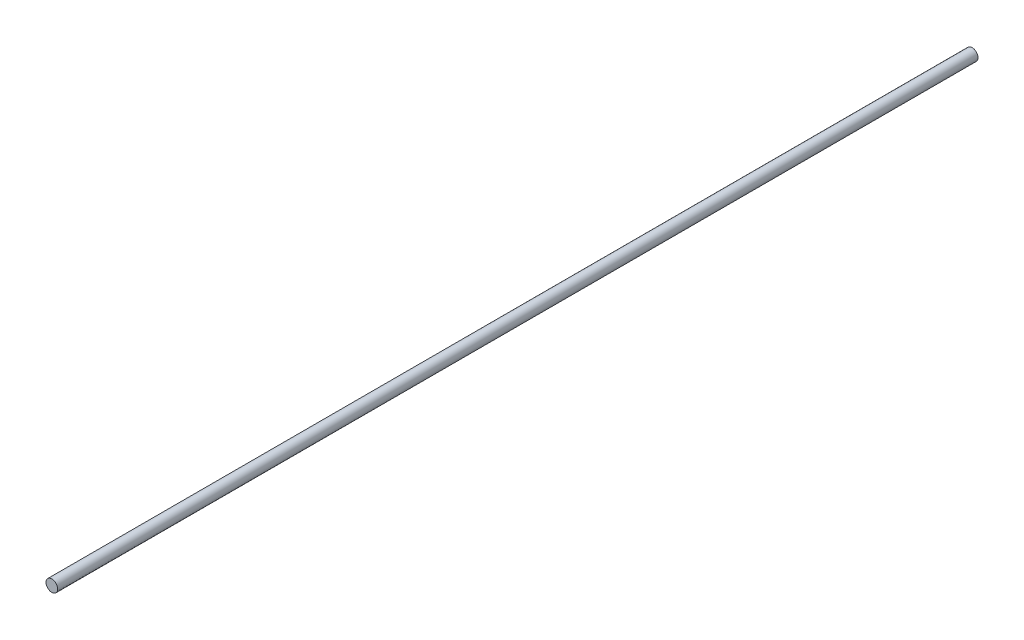
ISO-10303-21;
HEADER;
FILE_DESCRIPTION(('STEP AP214'),'2;1');
FILE_NAME('part.step','',(''),(''),'','','');
FILE_SCHEMA(('AUTOMOTIVE_DESIGN { 1 0 10303 214 1 1 1 1 }'));
ENDSEC;
DATA;
#1=APPLICATION_CONTEXT('core data for automotive mechanical design processes');
#2=APPLICATION_PROTOCOL_DEFINITION('international standard','automotive_design',2000,#1);
#3=PRODUCT_CONTEXT('',#1,'mechanical');
#4=PRODUCT('Part','Part','',(#3));
#5=PRODUCT_RELATED_PRODUCT_CATEGORY('part','',(#4));
#6=PRODUCT_DEFINITION_FORMATION('','',#4);
#7=PRODUCT_DEFINITION_CONTEXT('part definition',#1,'design');
#8=PRODUCT_DEFINITION('design','',#6,#7);
#9=PRODUCT_DEFINITION_SHAPE('','',#8);
#10=(LENGTH_UNIT() NAMED_UNIT(*) SI_UNIT(.MILLI.,.METRE.));
#11=(NAMED_UNIT(*) PLANE_ANGLE_UNIT() SI_UNIT($,.RADIAN.));
#12=(NAMED_UNIT(*) SI_UNIT($,.STERADIAN.) SOLID_ANGLE_UNIT());
#13=UNCERTAINTY_MEASURE_WITH_UNIT(LENGTH_MEASURE(1.E-05),#10,'distance_accuracy_value','');
#14=(GEOMETRIC_REPRESENTATION_CONTEXT(3) GLOBAL_UNCERTAINTY_ASSIGNED_CONTEXT((#13)) GLOBAL_UNIT_ASSIGNED_CONTEXT((#10,
#11,#12)) REPRESENTATION_CONTEXT('',''));
#15=CARTESIAN_POINT('',(0.,0.,0.));
#16=DIRECTION('',(0.,0.,1.));
#17=DIRECTION('',(1.,0.,0.));
#18=AXIS2_PLACEMENT_3D('',#15,#16,#17);
#19=CARTESIAN_POINT('',(0.,0.,153.75));
#20=DIRECTION('',(0.,0.,-1.));
#21=DIRECTION('',(-1.,0.,0.));
#22=AXIS2_PLACEMENT_3D('',#19,#20,#21);
#23=CYLINDRICAL_SURFACE('',#22,0.975);
#24=CARTESIAN_POINT('',(0.,0.,153.75));
#25=DIRECTION('',(0.,0.,1.));
#26=DIRECTION('',(1.,0.,0.));
#27=AXIS2_PLACEMENT_3D('',#24,#25,#26);
#28=CIRCLE('',#27,0.975);
#29=CARTESIAN_POINT('',(0.975,0.,153.75));
#30=VERTEX_POINT('',#29);
#31=EDGE_CURVE('E11',#30,#30,#28,.T.);
#32=ORIENTED_EDGE('',*,*,#31,.F.);
#33=EDGE_LOOP('',(#32));
#34=FACE_BOUND('',#33,.T.);
#35=CARTESIAN_POINT('',(0.,0.,0.));
#36=DIRECTION('',(0.,0.,1.));
#37=DIRECTION('',(1.,0.,0.));
#38=AXIS2_PLACEMENT_3D('',#35,#36,#37);
#39=CIRCLE('',#38,0.975);
#40=CARTESIAN_POINT('',(0.975,0.,0.));
#41=VERTEX_POINT('',#40);
#42=EDGE_CURVE('E47',#41,#41,#39,.T.);
#43=ORIENTED_EDGE('',*,*,#42,.T.);
#44=EDGE_LOOP('',(#43));
#45=FACE_BOUND('',#44,.T.);
#46=ADVANCED_FACE('F44',(#34,#45),#23,.T.);
#47=CARTESIAN_POINT('',(0.,0.,153.75));
#48=DIRECTION('',(0.,0.,1.));
#49=DIRECTION('',(1.,0.,0.));
#50=AXIS2_PLACEMENT_3D('',#47,#48,#49);
#51=PLANE('',#50);
#52=ORIENTED_EDGE('',*,*,#31,.T.);
#53=EDGE_LOOP('',(#52));
#54=FACE_BOUND('',#53,.T.);
#55=ADVANCED_FACE('F136',(#54),#51,.T.);
#56=CARTESIAN_POINT('',(0.,0.,0.));
#57=DIRECTION('',(0.,0.,1.));
#58=DIRECTION('',(1.,0.,0.));
#59=AXIS2_PLACEMENT_3D('',#56,#57,#58);
#60=PLANE('',#59);
#61=DIRECTION('',(-1.,0.,0.));
#62=VECTOR('',#61,1.);
#63=CARTESIAN_POINT('',(0.5,-0.5,0.));
#64=LINE('',#63,#62);
#65=CARTESIAN_POINT('',(0.5,-0.5,0.));
#66=VERTEX_POINT('',#65);
#67=CARTESIAN_POINT('',(-0.5,-0.5,0.));
#68=VERTEX_POINT('',#67);
#69=EDGE_CURVE('E93',#66,#68,#64,.T.);
#70=ORIENTED_EDGE('',*,*,#69,.F.);
#71=DIRECTION('',(0.,-1.,0.));
#72=VECTOR('',#71,1.);
#73=CARTESIAN_POINT('',(0.5,0.5,0.));
#74=LINE('',#73,#72);
#75=CARTESIAN_POINT('',(0.5,0.5,0.));
#76=VERTEX_POINT('',#75);
#77=EDGE_CURVE('E58',#76,#66,#74,.T.);
#78=ORIENTED_EDGE('',*,*,#77,.F.);
#79=DIRECTION('',(1.,0.,0.));
#80=VECTOR('',#79,1.);
#81=CARTESIAN_POINT('',(0.5,0.5,0.));
#82=LINE('',#81,#80);
#83=CARTESIAN_POINT('',(-0.5,0.5,0.));
#84=VERTEX_POINT('',#83);
#85=EDGE_CURVE('E109',#84,#76,#82,.T.);
#86=ORIENTED_EDGE('',*,*,#85,.F.);
#87=DIRECTION('',(0.,1.,0.));
#88=VECTOR('',#87,1.);
#89=CARTESIAN_POINT('',(-0.5,0.5,0.));
#90=LINE('',#89,#88);
#91=EDGE_CURVE('E115',#68,#84,#90,.T.);
#92=ORIENTED_EDGE('',*,*,#91,.F.);
#93=EDGE_LOOP('',(#70,#78,#86,#92));
#94=FACE_BOUND('',#93,.T.);
#95=ORIENTED_EDGE('',*,*,#42,.F.);
#96=EDGE_LOOP('',(#95));
#97=FACE_BOUND('',#96,.T.);
#98=ADVANCED_FACE('F121',(#94,#97),#60,.F.);
#99=CARTESIAN_POINT('',(0.5,0.5,5.));
#100=DIRECTION('',(1.,0.,0.));
#101=DIRECTION('',(0.,0.,-1.));
#102=AXIS2_PLACEMENT_3D('',#99,#100,#101);
#103=PLANE('',#102);
#104=ORIENTED_EDGE('',*,*,#77,.T.);
#105=DIRECTION('',(0.,0.,-1.));
#106=VECTOR('',#105,1.);
#107=CARTESIAN_POINT('',(0.5,-0.5,5.));
#108=LINE('',#107,#106);
#109=CARTESIAN_POINT('',(0.5,-0.5,5.));
#110=VERTEX_POINT('',#109);
#111=EDGE_CURVE('E81',#110,#66,#108,.T.);
#112=ORIENTED_EDGE('',*,*,#111,.F.);
#113=DIRECTION('',(0.,-1.,0.));
#114=VECTOR('',#113,1.);
#115=CARTESIAN_POINT('',(0.5,0.5,5.));
#116=LINE('',#115,#114);
#117=CARTESIAN_POINT('',(0.5,0.5,5.));
#118=VERTEX_POINT('',#117);
#119=EDGE_CURVE('E107',#118,#110,#116,.T.);
#120=ORIENTED_EDGE('',*,*,#119,.F.);
#121=DIRECTION('',(0.,0.,-1.));
#122=VECTOR('',#121,1.);
#123=CARTESIAN_POINT('',(0.5,0.5,5.));
#124=LINE('',#123,#122);
#125=EDGE_CURVE('E66',#118,#76,#124,.T.);
#126=ORIENTED_EDGE('',*,*,#125,.T.);
#127=EDGE_LOOP('',(#104,#112,#120,#126));
#128=FACE_BOUND('',#127,.T.);
#129=ADVANCED_FACE('F126',(#128),#103,.F.);
#130=CARTESIAN_POINT('',(0.5,0.5,5.));
#131=DIRECTION('',(0.,1.,0.));
#132=DIRECTION('',(0.,0.,1.));
#133=AXIS2_PLACEMENT_3D('',#130,#131,#132);
#134=PLANE('',#133);
#135=ORIENTED_EDGE('',*,*,#85,.T.);
#136=ORIENTED_EDGE('',*,*,#125,.F.);
#137=DIRECTION('',(1.,0.,0.));
#138=VECTOR('',#137,1.);
#139=CARTESIAN_POINT('',(0.5,0.5,5.));
#140=LINE('',#139,#138);
#141=CARTESIAN_POINT('',(-0.5,0.5,5.));
#142=VERTEX_POINT('',#141);
#143=EDGE_CURVE('E104',#142,#118,#140,.T.);
#144=ORIENTED_EDGE('',*,*,#143,.F.);
#145=DIRECTION('',(0.,0.,-1.));
#146=VECTOR('',#145,1.);
#147=CARTESIAN_POINT('',(-0.5,0.5,5.));
#148=LINE('',#147,#146);
#149=EDGE_CURVE('E97',#142,#84,#148,.T.);
#150=ORIENTED_EDGE('',*,*,#149,.T.);
#151=EDGE_LOOP('',(#135,#136,#144,#150));
#152=FACE_BOUND('',#151,.T.);
#153=ADVANCED_FACE('F124',(#152),#134,.F.);
#154=CARTESIAN_POINT('',(-0.5,0.5,5.));
#155=DIRECTION('',(-1.,0.,0.));
#156=DIRECTION('',(0.,0.,1.));
#157=AXIS2_PLACEMENT_3D('',#154,#155,#156);
#158=PLANE('',#157);
#159=ORIENTED_EDGE('',*,*,#91,.T.);
#160=ORIENTED_EDGE('',*,*,#149,.F.);
#161=DIRECTION('',(0.,1.,0.));
#162=VECTOR('',#161,1.);
#163=CARTESIAN_POINT('',(-0.5,0.5,5.));
#164=LINE('',#163,#162);
#165=CARTESIAN_POINT('',(-0.5,-0.5,5.));
#166=VERTEX_POINT('',#165);
#167=EDGE_CURVE('E100',#166,#142,#164,.T.);
#168=ORIENTED_EDGE('',*,*,#167,.F.);
#169=DIRECTION('',(0.,0.,-1.));
#170=VECTOR('',#169,1.);
#171=CARTESIAN_POINT('',(-0.5,-0.5,5.));
#172=LINE('',#171,#170);
#173=EDGE_CURVE('E86',#166,#68,#172,.T.);
#174=ORIENTED_EDGE('',*,*,#173,.T.);
#175=EDGE_LOOP('',(#159,#160,#168,#174));
#176=FACE_BOUND('',#175,.T.);
#177=ADVANCED_FACE('F101',(#176),#158,.F.);
#178=CARTESIAN_POINT('',(0.5,-0.5,5.));
#179=DIRECTION('',(0.,-1.,0.));
#180=DIRECTION('',(0.,0.,-1.));
#181=AXIS2_PLACEMENT_3D('',#178,#179,#180);
#182=PLANE('',#181);
#183=ORIENTED_EDGE('',*,*,#69,.T.);
#184=ORIENTED_EDGE('',*,*,#173,.F.);
#185=DIRECTION('',(-1.,0.,0.));
#186=VECTOR('',#185,1.);
#187=CARTESIAN_POINT('',(0.5,-0.5,5.));
#188=LINE('',#187,#186);
#189=EDGE_CURVE('E90',#110,#166,#188,.T.);
#190=ORIENTED_EDGE('',*,*,#189,.F.);
#191=ORIENTED_EDGE('',*,*,#111,.T.);
#192=EDGE_LOOP('',(#183,#184,#190,#191));
#193=FACE_BOUND('',#192,.T.);
#194=ADVANCED_FACE('F88',(#193),#182,.F.);
#195=CARTESIAN_POINT('',(0.,0.,5.));
#196=DIRECTION('',(0.,0.,-1.));
#197=DIRECTION('',(-1.,0.,0.));
#198=AXIS2_PLACEMENT_3D('',#195,#196,#197);
#199=PLANE('',#198);
#200=ORIENTED_EDGE('',*,*,#119,.T.);
#201=ORIENTED_EDGE('',*,*,#189,.T.);
#202=ORIENTED_EDGE('',*,*,#167,.T.);
#203=ORIENTED_EDGE('',*,*,#143,.T.);
#204=EDGE_LOOP('',(#200,#201,#202,#203));
#205=FACE_BOUND('',#204,.T.);
#206=ADVANCED_FACE('F106',(#205),#199,.T.);
#207=CLOSED_SHELL('',(#46,#55,#98,#129,#153,#177,#194,#206));
#208=MANIFOLD_SOLID_BREP('B2',#207);
#209=ADVANCED_BREP_SHAPE_REPRESENTATION('',(#18,#208),#14);
#210=SHAPE_DEFINITION_REPRESENTATION(#9,#209);
ENDSEC;
END-ISO-10303-21;
